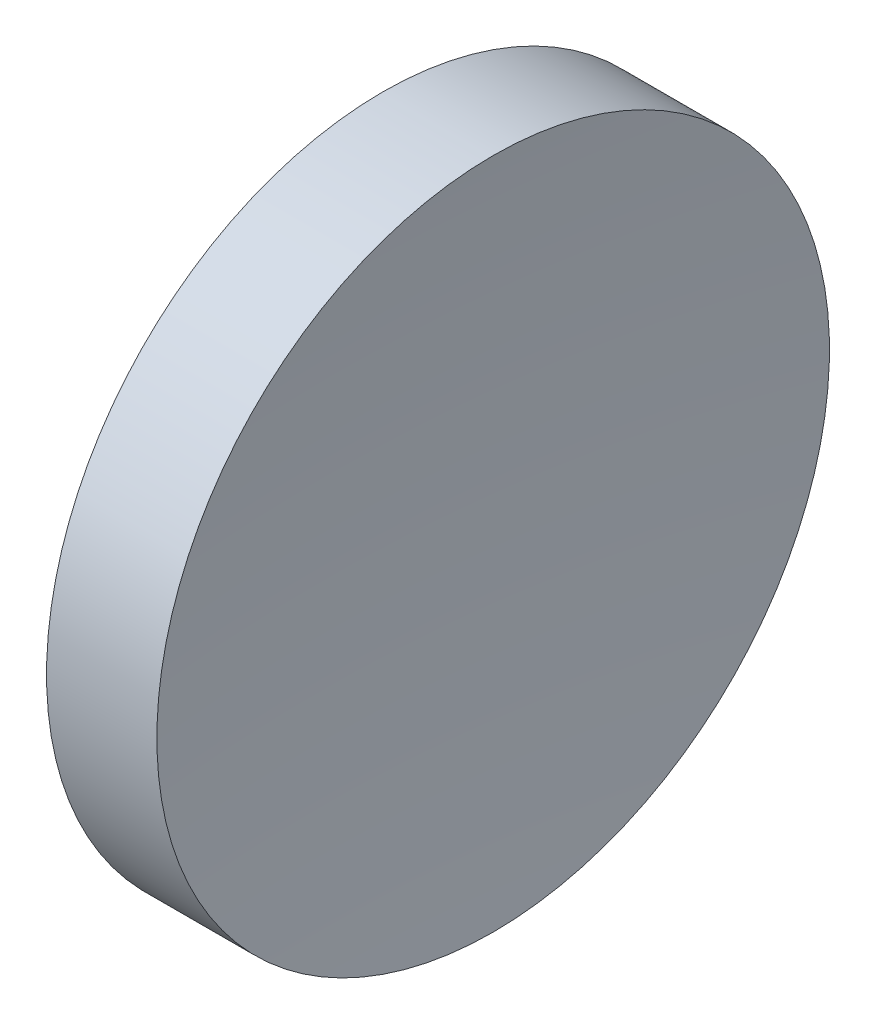
ISO-10303-21;
HEADER;
FILE_DESCRIPTION(('STEP AP214'),'2;1');
FILE_NAME('part.step','',(''),(''),'','','');
FILE_SCHEMA(('AUTOMOTIVE_DESIGN { 1 0 10303 214 1 1 1 1 }'));
ENDSEC;
DATA;
#1=APPLICATION_CONTEXT('core data for automotive mechanical design processes');
#2=APPLICATION_PROTOCOL_DEFINITION('international standard','automotive_design',2000,#1);
#3=PRODUCT_CONTEXT('',#1,'mechanical');
#4=PRODUCT('Part','Part','',(#3));
#5=PRODUCT_RELATED_PRODUCT_CATEGORY('part','',(#4));
#6=PRODUCT_DEFINITION_FORMATION('','',#4);
#7=PRODUCT_DEFINITION_CONTEXT('part definition',#1,'design');
#8=PRODUCT_DEFINITION('design','',#6,#7);
#9=PRODUCT_DEFINITION_SHAPE('','',#8);
#10=(LENGTH_UNIT() NAMED_UNIT(*) SI_UNIT(.MILLI.,.METRE.));
#11=(NAMED_UNIT(*) PLANE_ANGLE_UNIT() SI_UNIT($,.RADIAN.));
#12=(NAMED_UNIT(*) SI_UNIT($,.STERADIAN.) SOLID_ANGLE_UNIT());
#13=UNCERTAINTY_MEASURE_WITH_UNIT(LENGTH_MEASURE(1.E-05),#10,'distance_accuracy_value','');
#14=(GEOMETRIC_REPRESENTATION_CONTEXT(3) GLOBAL_UNCERTAINTY_ASSIGNED_CONTEXT((#13)) GLOBAL_UNIT_ASSIGNED_CONTEXT((#10,
#11,#12)) REPRESENTATION_CONTEXT('',''));
#15=CARTESIAN_POINT('',(0.,0.,0.));
#16=DIRECTION('',(0.,0.,1.));
#17=DIRECTION('',(1.,0.,0.));
#18=AXIS2_PLACEMENT_3D('',#15,#16,#17);
#19=CARTESIAN_POINT('',(85.006096741655,32.6084202354702,0.));
#20=DIRECTION('',(-1.,0.,0.));
#21=DIRECTION('',(0.,1.,0.));
#22=AXIS2_PLACEMENT_3D('',#19,#20,#21);
#23=SPHERICAL_SURFACE('',#22,23.7);
#24=CARTESIAN_POINT('',(62.1450490841219,32.6084202354702,0.));
#25=DIRECTION('',(-1.,0.,0.));
#26=DIRECTION('',(0.,-1.,0.));
#27=AXIS2_PLACEMENT_3D('',#24,#25,#26);
#28=CIRCLE('',#27,6.25);
#29=CARTESIAN_POINT('',(62.1450490841219,26.3584202354702,0.));
#30=VERTEX_POINT('',#29);
#31=EDGE_CURVE('E41',#30,#30,#28,.T.);
#32=ORIENTED_EDGE('',*,*,#31,.T.);
#33=EDGE_LOOP('',(#32));
#34=FACE_BOUND('',#33,.T.);
#35=ADVANCED_FACE('F35',(#34),#23,.T.);
#36=CARTESIAN_POINT('',(131.606096741655,32.6084202354702,0.));
#37=DIRECTION('',(-1.,0.,0.));
#38=DIRECTION('',(0.,1.,0.));
#39=AXIS2_PLACEMENT_3D('',#36,#37,#38);
#40=SPHERICAL_SURFACE('',#39,67.7);
#41=CARTESIAN_POINT('',(64.1952111221944,32.6084202354702,0.));
#42=DIRECTION('',(-1.,0.,0.));
#43=DIRECTION('',(0.,-1.,0.));
#44=AXIS2_PLACEMENT_3D('',#41,#42,#43);
#45=CIRCLE('',#44,6.24999999999999);
#46=CARTESIAN_POINT('',(64.1952111221944,26.3584202354702,0.));
#47=VERTEX_POINT('',#46);
#48=EDGE_CURVE('E10',#47,#47,#45,.T.);
#49=ORIENTED_EDGE('',*,*,#48,.F.);
#50=EDGE_LOOP('',(#49));
#51=FACE_BOUND('',#50,.T.);
#52=ADVANCED_FACE('F50',(#51),#40,.F.);
#53=CARTESIAN_POINT('',(57.9722456489816,32.6084202354702,0.));
#54=DIRECTION('',(-1.,0.,0.));
#55=DIRECTION('',(0.,-1.,0.));
#56=AXIS2_PLACEMENT_3D('',#53,#54,#55);
#57=CYLINDRICAL_SURFACE('',#56,6.25);
#58=ORIENTED_EDGE('',*,*,#31,.F.);
#59=EDGE_LOOP('',(#58));
#60=FACE_BOUND('',#59,.T.);
#61=ORIENTED_EDGE('',*,*,#48,.T.);
#62=EDGE_LOOP('',(#61));
#63=FACE_BOUND('',#62,.T.);
#64=ADVANCED_FACE('F48',(#60,#63),#57,.T.);
#65=CLOSED_SHELL('',(#35,#52,#64));
#66=MANIFOLD_SOLID_BREP('B2',#65);
#67=ADVANCED_BREP_SHAPE_REPRESENTATION('',(#18,#66),#14);
#68=SHAPE_DEFINITION_REPRESENTATION(#9,#67);
ENDSEC;
END-ISO-10303-21;
